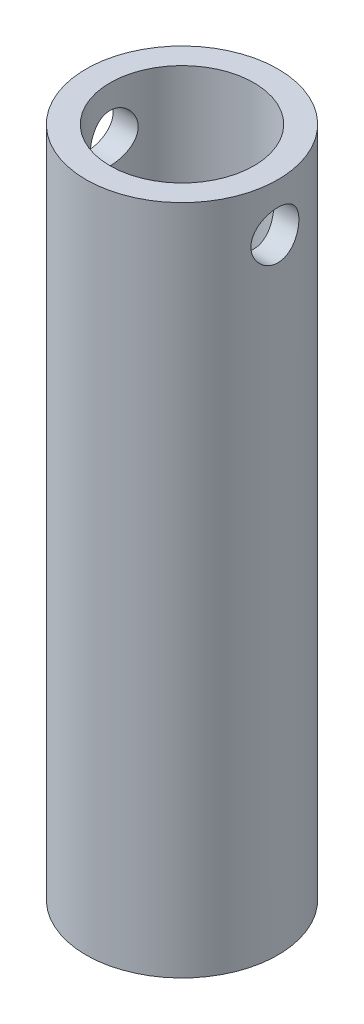
ISO-10303-21;
HEADER;
FILE_DESCRIPTION(('STEP AP214'),'2;1');
FILE_NAME('part.step','',(''),(''),'','','');
FILE_SCHEMA(('AUTOMOTIVE_DESIGN { 1 0 10303 214 1 1 1 1 }'));
ENDSEC;
DATA;
#1=APPLICATION_CONTEXT('core data for automotive mechanical design processes');
#2=APPLICATION_PROTOCOL_DEFINITION('international standard','automotive_design',2000,#1);
#3=PRODUCT_CONTEXT('',#1,'mechanical');
#4=PRODUCT('Part','Part','',(#3));
#5=PRODUCT_RELATED_PRODUCT_CATEGORY('part','',(#4));
#6=PRODUCT_DEFINITION_FORMATION('','',#4);
#7=PRODUCT_DEFINITION_CONTEXT('part definition',#1,'design');
#8=PRODUCT_DEFINITION('design','',#6,#7);
#9=PRODUCT_DEFINITION_SHAPE('','',#8);
#10=(LENGTH_UNIT() NAMED_UNIT(*) SI_UNIT(.MILLI.,.METRE.));
#11=(NAMED_UNIT(*) PLANE_ANGLE_UNIT() SI_UNIT($,.RADIAN.));
#12=(NAMED_UNIT(*) SI_UNIT($,.STERADIAN.) SOLID_ANGLE_UNIT());
#13=UNCERTAINTY_MEASURE_WITH_UNIT(LENGTH_MEASURE(1.E-05),#10,'distance_accuracy_value','');
#14=(GEOMETRIC_REPRESENTATION_CONTEXT(3) GLOBAL_UNCERTAINTY_ASSIGNED_CONTEXT((#13)) GLOBAL_UNIT_ASSIGNED_CONTEXT((#10,
#11,#12)) REPRESENTATION_CONTEXT('',''));
#15=CARTESIAN_POINT('',(0.,0.,0.));
#16=DIRECTION('',(0.,0.,1.));
#17=DIRECTION('',(1.,0.,0.));
#18=AXIS2_PLACEMENT_3D('',#15,#16,#17);
#19=CARTESIAN_POINT('',(0.,88.9,0.));
#20=DIRECTION('',(0.,1.,0.));
#21=DIRECTION('',(0.,0.,1.));
#22=AXIS2_PLACEMENT_3D('',#19,#20,#21);
#23=PLANE('',#22);
#24=CARTESIAN_POINT('',(0.,88.9,0.));
#25=DIRECTION('',(0.,1.,0.));
#26=DIRECTION('',(0.,0.,1.));
#27=AXIS2_PLACEMENT_3D('',#24,#25,#26);
#28=CIRCLE('',#27,12.7);
#29=CARTESIAN_POINT('',(0.,88.9,12.7));
#30=VERTEX_POINT('',#29);
#31=EDGE_CURVE('E10',#30,#30,#28,.T.);
#32=ORIENTED_EDGE('',*,*,#31,.T.);
#33=EDGE_LOOP('',(#32));
#34=FACE_BOUND('',#33,.T.);
#35=CARTESIAN_POINT('',(0.,88.9,0.));
#36=DIRECTION('',(0.,1.,0.));
#37=DIRECTION('',(0.,0.,1.));
#38=AXIS2_PLACEMENT_3D('',#35,#36,#37);
#39=CIRCLE('',#38,9.525);
#40=CARTESIAN_POINT('',(0.,88.9,9.525));
#41=VERTEX_POINT('',#40);
#42=EDGE_CURVE('E52',#41,#41,#39,.T.);
#43=ORIENTED_EDGE('',*,*,#42,.F.);
#44=EDGE_LOOP('',(#43));
#45=FACE_BOUND('',#44,.T.);
#46=ADVANCED_FACE('F34',(#34,#45),#23,.T.);
#47=CARTESIAN_POINT('',(0.,0.,0.));
#48=DIRECTION('',(0.,1.,0.));
#49=DIRECTION('',(0.,0.,1.));
#50=AXIS2_PLACEMENT_3D('',#47,#48,#49);
#51=PLANE('',#50);
#52=CARTESIAN_POINT('',(0.,0.,0.));
#53=DIRECTION('',(0.,1.,0.));
#54=DIRECTION('',(0.,0.,1.));
#55=AXIS2_PLACEMENT_3D('',#52,#53,#54);
#56=CIRCLE('',#55,12.7);
#57=CARTESIAN_POINT('',(0.,0.,12.7));
#58=VERTEX_POINT('',#57);
#59=EDGE_CURVE('E47',#58,#58,#56,.T.);
#60=ORIENTED_EDGE('',*,*,#59,.F.);
#61=EDGE_LOOP('',(#60));
#62=FACE_BOUND('',#61,.T.);
#63=CARTESIAN_POINT('',(0.,0.,0.));
#64=DIRECTION('',(0.,1.,0.));
#65=DIRECTION('',(0.,0.,1.));
#66=AXIS2_PLACEMENT_3D('',#63,#64,#65);
#67=CIRCLE('',#66,9.525);
#68=CARTESIAN_POINT('',(0.,0.,9.525));
#69=VERTEX_POINT('',#68);
#70=EDGE_CURVE('E55',#69,#69,#67,.T.);
#71=ORIENTED_EDGE('',*,*,#70,.T.);
#72=EDGE_LOOP('',(#71));
#73=FACE_BOUND('',#72,.T.);
#74=ADVANCED_FACE('F88',(#62,#73),#51,.F.);
#75=CARTESIAN_POINT('',(0.,88.9,0.));
#76=DIRECTION('',(0.,-1.,0.));
#77=DIRECTION('',(0.,0.,-1.));
#78=AXIS2_PLACEMENT_3D('',#75,#76,#77);
#79=CYLINDRICAL_SURFACE('',#78,12.7);
#80=CARTESIAN_POINT('',(-12.7,79.375,0.));
#81=CARTESIAN_POINT('',(-12.6999970338729,79.3750049228124,-0.175421054350931));
#82=CARTESIAN_POINT('',(-12.6963292371237,79.3895871158045,-0.350897100741783));
#83=CARTESIAN_POINT('',(-12.6820530760661,79.4474432369332,-0.696820051980962));
#84=CARTESIAN_POINT('',(-12.6714407780562,79.4907334268551,-0.867264049209732));
#85=CARTESIAN_POINT('',(-12.6444507573613,79.6045297531614,-1.19807751278645));
#86=CARTESIAN_POINT('',(-12.6280799601569,79.6750032072806,-1.35845880926017));
#87=CARTESIAN_POINT('',(-12.591316443928,79.8410506089283,-1.66512267919771));
#88=CARTESIAN_POINT('',(-12.5709235892463,79.9366254031185,-1.81140477687155));
#89=CARTESIAN_POINT('',(-12.5278602543575,80.1522416714347,-2.08873074612027));
#90=CARTESIAN_POINT('',(-12.5051546346353,80.2727028336633,-2.2194428772959));
#91=CARTESIAN_POINT('',(-12.4602582924963,80.5337738337241,-2.45903522924702));
#92=CARTESIAN_POINT('',(-12.4380676284689,80.674385943571,-2.56791298487579));
#93=CARTESIAN_POINT('',(-12.3963594189446,80.9743432299266,-2.76230618225783));
#94=CARTESIAN_POINT('',(-12.3768864828385,81.1339356718785,-2.84745052370821));
#95=CARTESIAN_POINT('',(-12.343330973648,81.4657341380137,-2.98957345643241));
#96=CARTESIAN_POINT('',(-12.3292475388652,81.6379381405527,-3.04655655068163));
#97=CARTESIAN_POINT('',(-12.3084267567388,81.9864237378602,-3.12960773790342));
#98=CARTESIAN_POINT('',(-12.3015478927701,82.1625545299471,-3.15627230130285));
#99=CARTESIAN_POINT('',(-12.2954915053947,82.5169134710486,-3.17978742389057));
#100=CARTESIAN_POINT('',(-12.2963127290578,82.6951412741317,-3.17664283351501));
#101=CARTESIAN_POINT('',(-12.3054365167726,83.0440634597277,-3.14110481048738));
#102=CARTESIAN_POINT('',(-12.3135572669877,83.2148357321016,-3.10942215340351));
#103=CARTESIAN_POINT('',(-12.3360753547043,83.5485608910951,-3.01884119561134));
#104=CARTESIAN_POINT('',(-12.3504731393489,83.7115132197445,-2.95994095604689));
#105=CARTESIAN_POINT('',(-12.3840899110031,84.026878801067,-2.81599106163371));
#106=CARTESIAN_POINT('',(-12.4033560981111,84.1791690636212,-2.73068344564302));
#107=CARTESIAN_POINT('',(-12.4445122129068,84.4675279356519,-2.53652078423165));
#108=CARTESIAN_POINT('',(-12.4664025994163,84.6035937000757,-2.42766161831205));
#109=CARTESIAN_POINT('',(-12.5111061380944,84.8597143198865,-2.1858042489086));
#110=CARTESIAN_POINT('',(-12.533927803951,84.9792020039632,-2.05220624645108));
#111=CARTESIAN_POINT('',(-12.5773596047503,85.1941849632152,-1.76659522538284));
#112=CARTESIAN_POINT('',(-12.5979696721291,85.2896795055245,-1.61458164448183));
#113=CARTESIAN_POINT('',(-12.6347586626604,85.4541737408416,-1.29564529770896));
#114=CARTESIAN_POINT('',(-12.6509221227036,85.5230813035385,-1.12867311562494));
#115=CARTESIAN_POINT('',(-12.676884242985,85.6316916304186,-0.785020883902451));
#116=CARTESIAN_POINT('',(-12.6866841206814,85.671399981085,-0.608342698201873));
#117=CARTESIAN_POINT('',(-12.6986347345774,85.7196185137662,-0.255142937325571));
#118=CARTESIAN_POINT('',(-12.7009747992585,85.7289010718594,-0.078733057308393));
#119=CARTESIAN_POINT('',(-12.6982813685726,85.7181229456492,0.273119584996509));
#120=CARTESIAN_POINT('',(-12.6932485369526,85.6980649027418,0.448562432914377));
#121=CARTESIAN_POINT('',(-12.6764961338622,85.6298115772382,0.790816868910218));
#122=CARTESIAN_POINT('',(-12.6648767569325,85.5820376589737,0.957717835150499));
#123=CARTESIAN_POINT('',(-12.6362609570897,85.4601900054731,1.28112793569114));
#124=CARTESIAN_POINT('',(-12.6192639911647,85.3861136142037,1.43763601861909));
#125=CARTESIAN_POINT('',(-12.5813250177716,85.2122668605486,1.73889063454312));
#126=CARTESIAN_POINT('',(-12.5603183592593,85.1120638954273,1.88337918521901));
#127=CARTESIAN_POINT('',(-12.5167921111412,84.8893613597127,2.15376466554498));
#128=CARTESIAN_POINT('',(-12.4942722608556,84.7668579411427,2.27965837982669));
#129=CARTESIAN_POINT('',(-12.4495762556412,84.4994458495475,2.51246336908673));
#130=CARTESIAN_POINT('',(-12.4274221051899,84.3540610286508,2.61883285313128));
#131=CARTESIAN_POINT('',(-12.3865825924258,84.0470492570416,2.8056644399122));
#132=CARTESIAN_POINT('',(-12.3678970761538,83.885423027713,2.88612769264176));
#133=CARTESIAN_POINT('',(-12.3363163381503,83.551382887573,3.01826384028539));
#134=CARTESIAN_POINT('',(-12.3233869021911,83.379039853404,3.07010730622841));
#135=CARTESIAN_POINT('',(-12.3047494152553,83.0277112665412,3.14398164687969));
#136=CARTESIAN_POINT('',(-12.299039785006,82.8487271753439,3.16601904149252));
#137=CARTESIAN_POINT('',(-12.2956087422145,82.4947104994796,3.17931501621073));
#138=CARTESIAN_POINT('',(-12.2976625750886,82.3197120956125,3.17143955029537));
#139=CARTESIAN_POINT('',(-12.3090074061494,81.9736234356237,3.12711523908729));
#140=CARTESIAN_POINT('',(-12.3182982588945,81.8025331010331,3.09066696801936));
#141=CARTESIAN_POINT('',(-12.3429450180984,81.4700587616563,2.99070462615689));
#142=CARTESIAN_POINT('',(-12.3582644892528,81.3086230372446,2.92735297324092));
#143=CARTESIAN_POINT('',(-12.3932474960913,80.9985566065863,2.7755107337966));
#144=CARTESIAN_POINT('',(-12.4129116342002,80.8499276800869,2.68701666057214));
#145=CARTESIAN_POINT('',(-12.4550092586011,80.5655093686132,2.48468673461548));
#146=CARTESIAN_POINT('',(-12.4775016056118,80.4301560612529,2.37025002816432));
#147=CARTESIAN_POINT('',(-12.5223699100401,80.1802920885162,2.1204541690182));
#148=CARTESIAN_POINT('',(-12.5447458385544,80.0657863795942,1.98509005500273));
#149=CARTESIAN_POINT('',(-12.5873437112106,79.8588460635383,1.69432305852049));
#150=CARTESIAN_POINT('',(-12.6075193062447,79.7668487343952,1.53860166056968));
#151=CARTESIAN_POINT('',(-12.6429542453062,79.6104845367759,1.21341315929717));
#152=CARTESIAN_POINT('',(-12.6582171100619,79.5460978699606,1.04395600927443));
#153=CARTESIAN_POINT('',(-12.6798505941374,79.4563396258022,0.729001702698684));
#154=CARTESIAN_POINT('',(-12.6873547169486,79.4259032022036,0.585004695088747));
#155=CARTESIAN_POINT('',(-12.6974304774096,79.3852320860002,0.294017851418468));
#156=CARTESIAN_POINT('',(-12.7000024860439,79.3749958739704,0.147028241296872));
#157=CARTESIAN_POINT('',(-12.7,79.375,0.));
#158=B_SPLINE_CURVE_WITH_KNOTS('',3,(#80,#81,#82,#83,#84,#85,#86,#87,#88,#89,#90,#91,#92,#93,
#94,#95,#96,#97,#98,#99,#100,#101,#102,#103,#104,#105,#106,#107,#108,#109,#110,#111,#112,#113,
#114,#115,#116,#117,#118,#119,#120,#121,#122,#123,#124,#125,#126,#127,#128,#129,#130,#131,#132,
#133,#134,#135,#136,#137,#138,#139,#140,#141,#142,#143,#144,#145,#146,#147,#148,#149,#150,#151,
#152,#153,#154,#155,#156,#157),.UNSPECIFIED.,.T.,.F.,(4,2,2,2,2,2,2,2,2,2,2,2,2,2,2,2,2,2,2,2,2,
2,2,2,2,2,2,2,2,2,2,2,2,2,2,2,2,2,4),(0.,0.525724358065501,1.05174676993359,1.57713870983893,
2.10254837335841,2.63767221675277,3.17285644277797,3.71599137305289,4.25903942808496,
4.79120824630598,5.32329047345571,5.84247618671882,6.36169889010143,6.88616284006739,
7.41071862276905,7.95023177058118,8.48976139571984,9.03114418076319,9.57242335981322,
10.09985087283,10.6272309069567,11.1467958106174,11.6664131950588,12.1952509368702,
12.7241800170733,13.266092111565,13.8079801469349,14.34660272276,14.8851074589671,
15.4081433519175,15.9311687337377,16.4510804786766,16.971064359066,17.5046127008447,
18.0382877269755,18.5816279265762,19.1245778677202,19.5652441424438,20.005877269746),.UNSPECIFIED.);
#159=CARTESIAN_POINT('',(-12.7,79.375,0.));
#160=VERTEX_POINT('',#159);
#161=EDGE_CURVE('E78',#160,#160,#158,.T.);
#162=ORIENTED_EDGE('',*,*,#161,.T.);
#163=EDGE_LOOP('',(#162));
#164=FACE_BOUND('',#163,.T.);
#165=CARTESIAN_POINT('',(12.2967221242085,82.55,-3.17500000000001));
#166=CARTESIAN_POINT('',(12.2967254711158,82.3746755463232,-3.17499501981321));
#167=CARTESIAN_POINT('',(12.3005126863854,82.1992959786783,-3.16042833178202));
#168=CARTESIAN_POINT('',(12.3152136473056,81.8535731757196,-3.10263936933902));
#169=CARTESIAN_POINT('',(12.3261315404947,81.6832329318254,-3.05940041756248));
#170=CARTESIAN_POINT('',(12.3537818023711,81.3526395065023,-2.94575382353269));
#171=CARTESIAN_POINT('',(12.3705066621688,81.1923736126601,-2.87538125437521));
#172=CARTESIAN_POINT('',(12.4078770387652,80.8859052172743,-2.70957184940196));
#173=CARTESIAN_POINT('',(12.4285227220068,80.7397033131581,-2.61413394947207));
#174=CARTESIAN_POINT('',(12.4719170977164,80.462295710517,-2.39865970268609));
#175=CARTESIAN_POINT('',(12.4946993898125,80.3314451275554,-2.27817284738414));
#176=CARTESIAN_POINT('',(12.5395085190442,80.0915830291624,-2.01699122140783));
#177=CARTESIAN_POINT('',(12.5615352853931,79.9825735554604,-1.87629456360898));
#178=CARTESIAN_POINT('',(12.6027232771114,79.7880351561083,-1.57625440537027));
#179=CARTESIAN_POINT('',(12.6218402299875,79.7028550870349,-1.4166781117678));
#180=CARTESIAN_POINT('',(12.65467131146,79.5606617519256,-1.0849142440518));
#181=CARTESIAN_POINT('',(12.6683862371462,79.5036443300673,-0.912728534955762));
#182=CARTESIAN_POINT('',(12.6886304373719,79.4205322500852,-0.564335623617784));
#183=CARTESIAN_POINT('',(12.6952996518228,79.3938345517053,-0.388280553827198));
#184=CARTESIAN_POINT('',(12.7011886451627,79.3702268583201,-0.0340726004637165));
#185=CARTESIAN_POINT('',(12.7004095254281,79.3733124592938,0.144079969063347));
#186=CARTESIAN_POINT('',(12.6915938059099,79.4087500598177,0.493243384772329));
#187=CARTESIAN_POINT('',(12.6837186297291,79.4404511328184,0.664324984533387));
#188=CARTESIAN_POINT('',(12.6617836238657,79.5311735129616,0.998658935538452));
#189=CARTESIAN_POINT('',(12.6477234649603,79.5901962744293,1.16191086950114));
#190=CARTESIAN_POINT('',(12.6147513732012,79.7344132647726,1.47766628361823));
#191=CARTESIAN_POINT('',(12.5957967501266,79.8198391467204,1.63005931850865));
#192=CARTESIAN_POINT('',(12.5550917783831,80.0142617124777,1.91857510093105));
#193=CARTESIAN_POINT('',(12.5333409435887,80.123262497072,2.05469501139648));
#194=CARTESIAN_POINT('',(12.4887191648708,80.3652301023176,2.31068256139473));
#195=CARTESIAN_POINT('',(12.4658338379713,80.4987657132816,2.43001063106374));
#196=CARTESIAN_POINT('',(12.4220610526701,80.7841919663962,2.64469999368258));
#197=CARTESIAN_POINT('',(12.4011736876753,80.9360834659537,2.74006016644613));
#198=CARTESIAN_POINT('',(12.3637103097324,81.2549683433691,2.9044523096467));
#199=CARTESIAN_POINT('',(12.347155693206,81.4220313774973,2.97335437513117));
#200=CARTESIAN_POINT('',(12.3205067298881,81.7658835444576,3.0819268455205));
#201=CARTESIAN_POINT('',(12.3104110007027,81.9426705872604,3.12160350580596));
#202=CARTESIAN_POINT('',(12.2981130212947,82.295948566943,3.16970364110571));
#203=CARTESIAN_POINT('',(12.2957093300071,82.4723239975431,3.17892490187727));
#204=CARTESIAN_POINT('',(12.2985192607316,82.8240938594633,3.16803657795424));
#205=CARTESIAN_POINT('',(12.3037321815428,82.9994883795958,3.14792969326923));
#206=CARTESIAN_POINT('',(12.3209949412092,83.3413551164847,3.07965533920157));
#207=CARTESIAN_POINT('',(12.3329315220802,83.5079263627429,3.03195236671801));
#208=CARTESIAN_POINT('',(12.3621891219376,83.8307079514737,2.91035496372147));
#209=CARTESIAN_POINT('',(12.3795107787294,83.9869170640008,2.83645743059486));
#210=CARTESIAN_POINT('',(12.418010941113,84.287920422891,2.66289874827947));
#211=CARTESIAN_POINT('',(12.439258441312,84.4324306268546,2.56276062737125));
#212=CARTESIAN_POINT('',(12.4830469550031,84.7028892207579,2.34016643006686));
#213=CARTESIAN_POINT('',(12.5055881806495,84.8288345541456,2.21770668600725));
#214=CARTESIAN_POINT('',(12.5501070185035,85.0618200240651,1.95028413912649));
#215=CARTESIAN_POINT('',(12.5720564161859,85.168308279437,1.80483494928778));
#216=CARTESIAN_POINT('',(12.6123346509939,85.3553485510281,1.49765601755557));
#217=CARTESIAN_POINT('',(12.6306636769502,85.4359019200924,1.33592712544033));
#218=CARTESIAN_POINT('',(12.6615204698767,85.5680864638505,1.00189729049619));
#219=CARTESIAN_POINT('',(12.6740898412846,85.6199256411614,0.8296826847635));
#220=CARTESIAN_POINT('',(12.6921932261265,85.6938346249527,0.478630489012187));
#221=CARTESIAN_POINT('',(12.6977285972965,85.7159101765986,0.299794184005915));
#222=CARTESIAN_POINT('',(12.7010848787296,85.7293420969023,-0.0542401964575716));
#223=CARTESIAN_POINT('',(12.6991103294396,85.7215129263779,-0.229405900617138));
#224=CARTESIAN_POINT('',(12.6881222125238,85.6772231483404,-0.575841801116851));
#225=CARTESIAN_POINT('',(12.6791088542401,85.6407633923332,-0.747112113154465));
#226=CARTESIAN_POINT('',(12.655087493111,85.5406842022275,-1.08004303817217));
#227=CARTESIAN_POINT('',(12.640112022951,85.4772120357269,-1.24175042029425));
#228=CARTESIAN_POINT('',(12.6057434230086,85.3250434116129,-1.55231164340717));
#229=CARTESIAN_POINT('',(12.5863497364056,85.2363437742712,-1.7011638610184));
#230=CARTESIAN_POINT('',(12.5446551773491,85.0337541320623,-1.985651122744));
#231=CARTESIAN_POINT('',(12.5222957878978,84.9193115462803,-2.12088408784723));
#232=CARTESIAN_POINT('',(12.4774531075658,84.6695574449719,-2.37050268936839));
#233=CARTESIAN_POINT('',(12.4549697867118,84.5342406463471,-2.48488303211819));
#234=CARTESIAN_POINT('',(12.4119473580947,84.2435405099484,-2.69164443404808));
#235=CARTESIAN_POINT('',(12.3914523466269,84.0878299083153,-2.78357526664701));
#236=CARTESIAN_POINT('',(12.3553205869608,83.7626738196474,-2.93981789665888));
#237=CARTESIAN_POINT('',(12.3396803064045,83.593238432652,-3.00414978846309));
#238=CARTESIAN_POINT('',(12.3174731028359,83.2784179874233,-3.09379152821294));
#239=CARTESIAN_POINT('',(12.3097500503611,83.134539203074,-3.1241783166451));
#240=CARTESIAN_POINT('',(12.2993733749982,82.8437863409323,-3.16478377891537));
#241=CARTESIAN_POINT('',(12.2967193196792,82.696912519724,-3.17500417313031));
#242=CARTESIAN_POINT('',(12.2967221242085,82.55,-3.17500000000001));
#243=B_SPLINE_CURVE_WITH_KNOTS('',3,(#165,#166,#167,#168,#169,#170,#171,#172,#173,#174,#175,
#176,#177,#178,#179,#180,#181,#182,#183,#184,#185,#186,#187,#188,#189,#190,#191,#192,#193,#194,
#195,#196,#197,#198,#199,#200,#201,#202,#203,#204,#205,#206,#207,#208,#209,#210,#211,#212,#213,
#214,#215,#216,#217,#218,#219,#220,#221,#222,#223,#224,#225,#226,#227,#228,#229,#230,#231,#232,
#233,#234,#235,#236,#237,#238,#239,#240,#241,#242),.UNSPECIFIED.,.T.,.F.,(4,2,2,2,2,2,2,2,2,2,2,
2,2,2,2,2,2,2,2,2,2,2,2,2,2,2,2,2,2,2,2,2,2,2,2,2,2,2,4),(0.,0.525433851004879,1.05117359161441,
1.57623602350085,2.10132074979459,2.63682421825082,3.17237772279432,3.71540400425359,
4.25835013005807,4.7902971376409,5.32216548805846,5.84223193614963,6.36232607040479,
6.88711950303145,7.41200429545519,7.95109492546326,8.49021074623749,9.03194068650671,
9.57355464164524,10.1008633995054,10.6281236152971,11.1467570436797,11.6654519221148,
12.1943221424741,12.7232793399029,13.2654717033223,13.8076357797011,14.3458193247108,
14.8838989712076,15.4074297658815,15.9309449907504,16.4516419323711,16.9724045329363,
17.5056431266551,18.0390169009447,18.5823412615974,19.1252693614627,19.5655924052587,
20.0058778838705),.UNSPECIFIED.);
#244=CARTESIAN_POINT('',(12.2967221242085,82.55,-3.17500000000001));
#245=VERTEX_POINT('',#244);
#246=EDGE_CURVE('E74',#245,#245,#243,.T.);
#247=ORIENTED_EDGE('',*,*,#246,.T.);
#248=EDGE_LOOP('',(#247));
#249=FACE_BOUND('',#248,.T.);
#250=ORIENTED_EDGE('',*,*,#31,.F.);
#251=EDGE_LOOP('',(#250));
#252=FACE_BOUND('',#251,.T.);
#253=ORIENTED_EDGE('',*,*,#59,.T.);
#254=EDGE_LOOP('',(#253));
#255=FACE_BOUND('',#254,.T.);
#256=ADVANCED_FACE('F36',(#164,#249,#252,#255),#79,.T.);
#257=CARTESIAN_POINT('',(0.,88.9,0.));
#258=DIRECTION('',(0.,-1.,0.));
#259=DIRECTION('',(0.,0.,-1.));
#260=AXIS2_PLACEMENT_3D('',#257,#258,#259);
#261=CYLINDRICAL_SURFACE('',#260,9.525);
#262=CARTESIAN_POINT('',(-8.98025612106915,82.55,-3.17500000000001));
#263=CARTESIAN_POINT('',(-8.98025555134127,82.7229364551045,-3.17500081898399));
#264=CARTESIAN_POINT('',(-8.98530617498472,82.8958679894399,-3.16082293820154));
#265=CARTESIAN_POINT('',(-9.00485797707984,83.2366077866567,-3.10467734311197));
#266=CARTESIAN_POINT('',(-9.01936071226449,83.4044152008451,-3.06270505113467));
#267=CARTESIAN_POINT('',(-9.05599546711913,83.7299153852664,-2.95260866704958));
#268=CARTESIAN_POINT('',(-9.07811252608946,83.8876272759806,-2.88453582795531));
#269=CARTESIAN_POINT('',(-9.12746212382781,84.1894431541398,-2.72434567030139));
#270=CARTESIAN_POINT('',(-9.15469579088969,84.3335441296078,-2.63222304663108));
#271=CARTESIAN_POINT('',(-9.21240503868727,84.6096858804242,-2.42268738995614));
#272=CARTESIAN_POINT('',(-9.24296141131744,84.7411164860327,-2.30449228387489));
#273=CARTESIAN_POINT('',(-9.30319020743184,84.9827065938882,-2.0478358434057));
#274=CARTESIAN_POINT('',(-9.33286248831953,85.092862680274,-1.9093712607913));
#275=CARTESIAN_POINT('',(-9.38891527476711,85.2915454990215,-1.61164431278892));
#276=CARTESIAN_POINT('',(-9.41518969452597,85.379432906712,-1.45193356813788));
#277=CARTESIAN_POINT('',(-9.4605343799787,85.5268532827798,-1.11896913298524));
#278=CARTESIAN_POINT('',(-9.47960658694531,85.5863938928367,-0.945719107056903));
#279=CARTESIAN_POINT('',(-9.50782564496303,85.6733613384578,-0.596991495351347));
#280=CARTESIAN_POINT('',(-9.5172947441875,85.701833441866,-0.421801146658178));
#281=CARTESIAN_POINT('',(-9.52638456092937,85.7291792314201,-0.0688907525664888));
#282=CARTESIAN_POINT('',(-9.52600781684693,85.7280605464964,0.108828629001866));
#283=CARTESIAN_POINT('',(-9.51566675789472,85.6969194917529,0.454353660740353));
#284=CARTESIAN_POINT('',(-9.50607905597498,85.6680324720935,0.622274754278499));
#285=CARTESIAN_POINT('',(-9.47886621303648,85.584052285387,0.950732918260385));
#286=CARTESIAN_POINT('',(-9.46124052729002,85.5289573422391,1.111269487449));
#287=CARTESIAN_POINT('',(-9.41945253180987,85.3934623175533,1.42288410762325));
#288=CARTESIAN_POINT('',(-9.3952073501375,85.3127391451148,1.57381010157607));
#289=CARTESIAN_POINT('',(-9.34270397898568,85.1285454352005,1.86030973354923));
#290=CARTESIAN_POINT('',(-9.31444467439657,85.0250685724348,1.99587908667345));
#291=CARTESIAN_POINT('',(-9.25532159123422,84.7925838007655,2.25457025130039));
#292=CARTESIAN_POINT('',(-9.22439783161187,84.6626032238533,2.37680549868223));
#293=CARTESIAN_POINT('',(-9.1645528941526,84.383725295818,2.59803029922419));
#294=CARTESIAN_POINT('',(-9.13563202542329,84.2348250348135,2.69701626991889));
#295=CARTESIAN_POINT('',(-9.08273917259532,83.9195247387091,2.87016016973847));
#296=CARTESIAN_POINT('',(-9.05884361979074,83.752905483066,2.94394402199775));
#297=CARTESIAN_POINT('',(-9.01959241367422,83.4086108233692,3.06210713863013));
#298=CARTESIAN_POINT('',(-9.00423318171519,83.2309400871702,3.10649872649828));
#299=CARTESIAN_POINT('',(-8.98460345301983,82.8781732215682,3.16281207065962));
#300=CARTESIAN_POINT('',(-8.9798639401205,82.703322576423,3.17610837823672));
#301=CARTESIAN_POINT('',(-8.98069933787911,82.3538607265627,3.17374726853834));
#302=CARTESIAN_POINT('',(-8.98627237514011,82.1792494841238,3.15809511009496));
#303=CARTESIAN_POINT('',(-9.00663737436701,81.8414766338647,3.09951644367857));
#304=CARTESIAN_POINT('',(-9.02110608274668,81.6781277592711,3.05754530088866));
#305=CARTESIAN_POINT('',(-9.05727657905498,81.3608240501906,2.94866651362947));
#306=CARTESIAN_POINT('',(-9.07897964918116,81.2068708866993,2.88175444845385));
#307=CARTESIAN_POINT('',(-9.12802586366623,80.9073171638108,2.72248103184611));
#308=CARTESIAN_POINT('',(-9.1555260648837,80.7621364096123,2.62937980078821));
#309=CARTESIAN_POINT('',(-9.21276315720815,80.4889612836817,2.42120937702023));
#310=CARTESIAN_POINT('',(-9.24250070609047,80.3609719972506,2.30613370845862));
#311=CARTESIAN_POINT('',(-9.30259247675171,80.1194486505122,2.05070616623352));
#312=CARTESIAN_POINT('',(-9.33290753359822,80.0069063116902,1.90940458398561));
#313=CARTESIAN_POINT('',(-9.38932753871621,79.807066248045,1.6091766501958));
#314=CARTESIAN_POINT('',(-9.41543263651181,79.7197676265593,1.45025092494494));
#315=CARTESIAN_POINT('',(-9.46036988448665,79.573691167064,1.12007606322252));
#316=CARTESIAN_POINT('',(-9.47924920264386,79.5147276950549,0.948915816544776));
#317=CARTESIAN_POINT('',(-9.50781089409934,79.4266644189592,0.598355629061082));
#318=CARTESIAN_POINT('',(-9.51749658708009,79.3975538351294,0.418958686953581));
#319=CARTESIAN_POINT('',(-9.52632915775114,79.3709929036021,0.0660886913556152));
#320=CARTESIAN_POINT('',(-9.52594996283969,79.3721188337647,-0.107266498446073));
#321=CARTESIAN_POINT('',(-9.51586223949088,79.4024869533649,-0.451202885375565));
#322=CARTESIAN_POINT('',(-9.50615446789103,79.431726861885,-0.621784306400517));
#323=CARTESIAN_POINT('',(-9.47867404980259,79.5165485947787,-0.952633729196799));
#324=CARTESIAN_POINT('',(-9.46103195296646,79.5717046337456,-1.11302251014812));
#325=CARTESIAN_POINT('',(-9.41949985236771,79.7063986612335,-1.42233126423386));
#326=CARTESIAN_POINT('',(-9.39560871852452,79.7859410602505,-1.57124915665223));
#327=CARTESIAN_POINT('',(-9.34294133528522,79.9705332009239,-1.8593880017804));
#328=CARTESIAN_POINT('',(-9.31401720161866,80.0764168260867,-1.99804734869541));
#329=CARTESIAN_POINT('',(-9.25490239414217,80.3092672169209,-2.25609475841497));
#330=CARTESIAN_POINT('',(-9.22471131854583,80.4362407091842,-2.37547664865809));
#331=CARTESIAN_POINT('',(-9.16505913446274,80.7136097039886,-2.59633024304516));
#332=CARTESIAN_POINT('',(-9.13567286363902,80.8647274973508,-2.69691791704334));
#333=CARTESIAN_POINT('',(-9.08241113800573,81.1826368054163,-2.87119803998105));
#334=CARTESIAN_POINT('',(-9.05853424386966,81.3494242103692,-2.94489751640184));
#335=CARTESIAN_POINT('',(-9.02021736105683,81.6862787912496,-3.06020415454823));
#336=CARTESIAN_POINT('',(-9.00539959321553,81.855856936693,-3.10311136154973));
#337=CARTESIAN_POINT('',(-8.9854209273797,82.2002929602318,-3.16050396647393));
#338=CARTESIAN_POINT('',(-8.98025669710439,82.375148995279,-3.17499917194919));
#339=CARTESIAN_POINT('',(-8.98025612106915,82.55,-3.17500000000001));
#340=B_SPLINE_CURVE_WITH_KNOTS('',3,(#262,#263,#264,#265,#266,#267,#268,#269,#270,#271,#272,
#273,#274,#275,#276,#277,#278,#279,#280,#281,#282,#283,#284,#285,#286,#287,#288,#289,#290,#291,
#292,#293,#294,#295,#296,#297,#298,#299,#300,#301,#302,#303,#304,#305,#306,#307,#308,#309,#310,
#311,#312,#313,#314,#315,#316,#317,#318,#319,#320,#321,#322,#323,#324,#325,#326,#327,#328,#329,
#330,#331,#332,#333,#334,#335,#336,#337,#338,#339),.UNSPECIFIED.,.T.,.F.,(4,2,2,2,2,2,2,2,2,2,2,
2,2,2,2,2,2,2,2,2,2,2,2,2,2,2,2,2,2,2,2,2,2,2,2,2,2,2,4),(0.,0.51816185673794,1.03640907467314,
1.55364379231514,2.07099270263878,2.6067174633253,3.14252816921061,3.69231882006111,
4.24196117528055,4.77247962078666,5.30286129234889,5.81244090321181,6.32205505300826,
6.83836754181563,7.35482374200019,7.89559553605437,8.43645060268435,8.98501631501702,
9.53335188057254,10.056948750821,10.5804505128322,11.0859695656586,11.5915782629155,
12.1132237331089,12.6350231697725,13.1819271594322,13.7288117205517,14.2720628703095,
14.815117785382,15.3326491885149,15.8501386073105,16.3594083542836,16.8687702617329,
17.3969527447801,17.925304015736,18.4743376618726,19.023227709973,19.5473069861654,
20.0712053232972),.UNSPECIFIED.);
#341=CARTESIAN_POINT('',(-8.98025612106915,82.55,-3.17500000000001));
#342=VERTEX_POINT('',#341);
#343=EDGE_CURVE('E39',#342,#342,#340,.T.);
#344=ORIENTED_EDGE('',*,*,#343,.F.);
#345=EDGE_LOOP('',(#344));
#346=FACE_BOUND('',#345,.T.);
#347=CARTESIAN_POINT('',(8.98025612106915,82.55,-3.17500000000001));
#348=CARTESIAN_POINT('',(8.98025555134127,82.3770635448955,-3.17500081898399));
#349=CARTESIAN_POINT('',(8.98530617498472,82.2041320105601,-3.16082293820154));
#350=CARTESIAN_POINT('',(9.00485797707984,81.8633922133433,-3.10467734311197));
#351=CARTESIAN_POINT('',(9.01936071226449,81.6955847991549,-3.06270505113467));
#352=CARTESIAN_POINT('',(9.05599546711913,81.3700846147336,-2.95260866704958));
#353=CARTESIAN_POINT('',(9.07811252608946,81.2123727240194,-2.88453582795531));
#354=CARTESIAN_POINT('',(9.12746212382781,80.9105568458602,-2.72434567030139));
#355=CARTESIAN_POINT('',(9.15469579088969,80.7664558703922,-2.63222304663108));
#356=CARTESIAN_POINT('',(9.21240503868727,80.4903141195758,-2.42268738995614));
#357=CARTESIAN_POINT('',(9.24296141131744,80.3588835139673,-2.30449228387489));
#358=CARTESIAN_POINT('',(9.30319020743184,80.1172934061118,-2.0478358434057));
#359=CARTESIAN_POINT('',(9.33286248831953,80.007137319726,-1.9093712607913));
#360=CARTESIAN_POINT('',(9.38891527476711,79.8084545009785,-1.61164431278892));
#361=CARTESIAN_POINT('',(9.41518969452597,79.720567093288,-1.45193356813788));
#362=CARTESIAN_POINT('',(9.4605343799787,79.5731467172202,-1.11896913298524));
#363=CARTESIAN_POINT('',(9.47960658694531,79.5136061071633,-0.945719107056903));
#364=CARTESIAN_POINT('',(9.50782564496303,79.4266386615422,-0.596991495351347));
#365=CARTESIAN_POINT('',(9.5172947441875,79.398166558134,-0.421801146658178));
#366=CARTESIAN_POINT('',(9.52638456092937,79.3708207685799,-0.0688907525664888));
#367=CARTESIAN_POINT('',(9.52600781684693,79.3719394535036,0.108828629001866));
#368=CARTESIAN_POINT('',(9.51566675789472,79.4030805082471,0.454353660740353));
#369=CARTESIAN_POINT('',(9.50607905597498,79.4319675279065,0.622274754278499));
#370=CARTESIAN_POINT('',(9.47886621303648,79.515947714613,0.950732918260385));
#371=CARTESIAN_POINT('',(9.46124052729002,79.5710426577609,1.111269487449));
#372=CARTESIAN_POINT('',(9.41945253180987,79.7065376824467,1.42288410762325));
#373=CARTESIAN_POINT('',(9.3952073501375,79.7872608548852,1.57381010157607));
#374=CARTESIAN_POINT('',(9.34270397898568,79.9714545647995,1.86030973354923));
#375=CARTESIAN_POINT('',(9.31444467439657,80.0749314275652,1.99587908667345));
#376=CARTESIAN_POINT('',(9.25532159123422,80.3074161992345,2.25457025130039));
#377=CARTESIAN_POINT('',(9.22439783161187,80.4373967761467,2.37680549868223));
#378=CARTESIAN_POINT('',(9.1645528941526,80.716274704182,2.59803029922419));
#379=CARTESIAN_POINT('',(9.13563202542329,80.8651749651865,2.69701626991889));
#380=CARTESIAN_POINT('',(9.08273917259532,81.1804752612909,2.87016016973847));
#381=CARTESIAN_POINT('',(9.05884361979074,81.347094516934,2.94394402199775));
#382=CARTESIAN_POINT('',(9.01959241367422,81.6913891766308,3.06210713863013));
#383=CARTESIAN_POINT('',(9.00423318171519,81.8690599128298,3.10649872649828));
#384=CARTESIAN_POINT('',(8.98460345301983,82.2218267784318,3.16281207065962));
#385=CARTESIAN_POINT('',(8.9798639401205,82.396677423577,3.17610837823672));
#386=CARTESIAN_POINT('',(8.98069933787911,82.7461392734373,3.17374726853834));
#387=CARTESIAN_POINT('',(8.98627237514011,82.9207505158762,3.15809511009496));
#388=CARTESIAN_POINT('',(9.00663737436701,83.2585233661353,3.09951644367857));
#389=CARTESIAN_POINT('',(9.02110608274668,83.4218722407289,3.05754530088866));
#390=CARTESIAN_POINT('',(9.05727657905498,83.7391759498094,2.94866651362947));
#391=CARTESIAN_POINT('',(9.07897964918116,83.8931291133007,2.88175444845385));
#392=CARTESIAN_POINT('',(9.12802586366623,84.1926828361892,2.72248103184611));
#393=CARTESIAN_POINT('',(9.1555260648837,84.3378635903877,2.62937980078821));
#394=CARTESIAN_POINT('',(9.21276315720815,84.6110387163183,2.42120937702023));
#395=CARTESIAN_POINT('',(9.24250070609047,84.7390280027494,2.30613370845862));
#396=CARTESIAN_POINT('',(9.30259247675171,84.9805513494878,2.05070616623352));
#397=CARTESIAN_POINT('',(9.33290753359822,85.0930936883098,1.90940458398561));
#398=CARTESIAN_POINT('',(9.38932753871621,85.292933751955,1.6091766501958));
#399=CARTESIAN_POINT('',(9.41543263651181,85.3802323734407,1.45025092494494));
#400=CARTESIAN_POINT('',(9.46036988448665,85.526308832936,1.12007606322252));
#401=CARTESIAN_POINT('',(9.47924920264386,85.5852723049451,0.948915816544776));
#402=CARTESIAN_POINT('',(9.50781089409934,85.6733355810408,0.598355629061082));
#403=CARTESIAN_POINT('',(9.51749658708009,85.7024461648706,0.418958686953581));
#404=CARTESIAN_POINT('',(9.52632915775114,85.7290070963979,0.0660886913556152));
#405=CARTESIAN_POINT('',(9.52594996283969,85.7278811662353,-0.107266498446073));
#406=CARTESIAN_POINT('',(9.51586223949088,85.6975130466351,-0.451202885375565));
#407=CARTESIAN_POINT('',(9.50615446789103,85.668273138115,-0.621784306400517));
#408=CARTESIAN_POINT('',(9.47867404980259,85.5834514052213,-0.952633729196799));
#409=CARTESIAN_POINT('',(9.46103195296646,85.5282953662544,-1.11302251014812));
#410=CARTESIAN_POINT('',(9.41949985236771,85.3936013387665,-1.42233126423386));
#411=CARTESIAN_POINT('',(9.39560871852452,85.3140589397495,-1.57124915665223));
#412=CARTESIAN_POINT('',(9.34294133528522,85.1294667990761,-1.8593880017804));
#413=CARTESIAN_POINT('',(9.31401720161866,85.0235831739133,-1.99804734869541));
#414=CARTESIAN_POINT('',(9.25490239414217,84.7907327830791,-2.25609475841497));
#415=CARTESIAN_POINT('',(9.22471131854583,84.6637592908158,-2.37547664865809));
#416=CARTESIAN_POINT('',(9.16505913446274,84.3863902960114,-2.59633024304516));
#417=CARTESIAN_POINT('',(9.13567286363902,84.2352725026492,-2.69691791704335));
#418=CARTESIAN_POINT('',(9.08241113800573,83.9173631945837,-2.87119803998105));
#419=CARTESIAN_POINT('',(9.05853424386966,83.7505757896308,-2.94489751640184));
#420=CARTESIAN_POINT('',(9.02021736105684,83.4137212087504,-3.06020415454823));
#421=CARTESIAN_POINT('',(9.00539959321553,83.244143063307,-3.10311136154973));
#422=CARTESIAN_POINT('',(8.9854209273797,82.8997070397682,-3.16050396647393));
#423=CARTESIAN_POINT('',(8.98025669710439,82.724851004721,-3.17499917194919));
#424=CARTESIAN_POINT('',(8.98025612106915,82.55,-3.17500000000001));
#425=B_SPLINE_CURVE_WITH_KNOTS('',3,(#347,#348,#349,#350,#351,#352,#353,#354,#355,#356,#357,
#358,#359,#360,#361,#362,#363,#364,#365,#366,#367,#368,#369,#370,#371,#372,#373,#374,#375,#376,
#377,#378,#379,#380,#381,#382,#383,#384,#385,#386,#387,#388,#389,#390,#391,#392,#393,#394,#395,
#396,#397,#398,#399,#400,#401,#402,#403,#404,#405,#406,#407,#408,#409,#410,#411,#412,#413,#414,
#415,#416,#417,#418,#419,#420,#421,#422,#423,#424),.UNSPECIFIED.,.T.,.F.,(4,2,2,2,2,2,2,2,2,2,2,
2,2,2,2,2,2,2,2,2,2,2,2,2,2,2,2,2,2,2,2,2,2,2,2,2,2,2,4),(0.,0.51816185673794,1.03640907467314,
1.55364379231514,2.07099270263878,2.6067174633253,3.14252816921061,3.69231882006111,
4.24196117528055,4.77247962078666,5.30286129234889,5.81244090321181,6.32205505300826,
6.83836754181563,7.35482374200019,7.89559553605437,8.43645060268435,8.98501631501702,
9.53335188057254,10.056948750821,10.5804505128322,11.0859695656586,11.5915782629155,
12.1132237331089,12.6350231697725,13.1819271594322,13.7288117205517,14.2720628703095,
14.815117785382,15.3326491885149,15.8501386073105,16.3594083542836,16.8687702617329,
17.3969527447801,17.925304015736,18.4743376618726,19.023227709973,19.5473069861654,
20.0712053232972),.UNSPECIFIED.);
#426=CARTESIAN_POINT('',(8.98025612106915,82.55,-3.17500000000001));
#427=VERTEX_POINT('',#426);
#428=EDGE_CURVE('E57',#427,#427,#425,.T.);
#429=ORIENTED_EDGE('',*,*,#428,.F.);
#430=EDGE_LOOP('',(#429));
#431=FACE_BOUND('',#430,.T.);
#432=ORIENTED_EDGE('',*,*,#42,.T.);
#433=EDGE_LOOP('',(#432));
#434=FACE_BOUND('',#433,.T.);
#435=ORIENTED_EDGE('',*,*,#70,.F.);
#436=EDGE_LOOP('',(#435));
#437=FACE_BOUND('',#436,.T.);
#438=ADVANCED_FACE('F61',(#346,#431,#434,#437),#261,.F.);
#439=CARTESIAN_POINT('',(-12.7,82.55,0.));
#440=DIRECTION('',(1.,0.,0.));
#441=DIRECTION('',(0.,0.,-1.));
#442=AXIS2_PLACEMENT_3D('',#439,#440,#441);
#443=CYLINDRICAL_SURFACE('',#442,3.175);
#444=ORIENTED_EDGE('',*,*,#428,.T.);
#445=EDGE_LOOP('',(#444));
#446=FACE_BOUND('',#445,.T.);
#447=ORIENTED_EDGE('',*,*,#246,.F.);
#448=EDGE_LOOP('',(#447));
#449=FACE_BOUND('',#448,.T.);
#450=ADVANCED_FACE('F67',(#446,#449),#443,.F.);
#451=ORIENTED_EDGE('',*,*,#343,.T.);
#452=EDGE_LOOP('',(#451));
#453=FACE_BOUND('',#452,.T.);
#454=ORIENTED_EDGE('',*,*,#161,.F.);
#455=EDGE_LOOP('',(#454));
#456=FACE_BOUND('',#455,.T.);
#457=ADVANCED_FACE('F64',(#453,#456),#443,.F.);
#458=CLOSED_SHELL('',(#46,#74,#256,#438,#450,#457));
#459=MANIFOLD_SOLID_BREP('B2',#458);
#460=ADVANCED_BREP_SHAPE_REPRESENTATION('',(#18,#459),#14);
#461=SHAPE_DEFINITION_REPRESENTATION(#9,#460);
ENDSEC;
END-ISO-10303-21;
